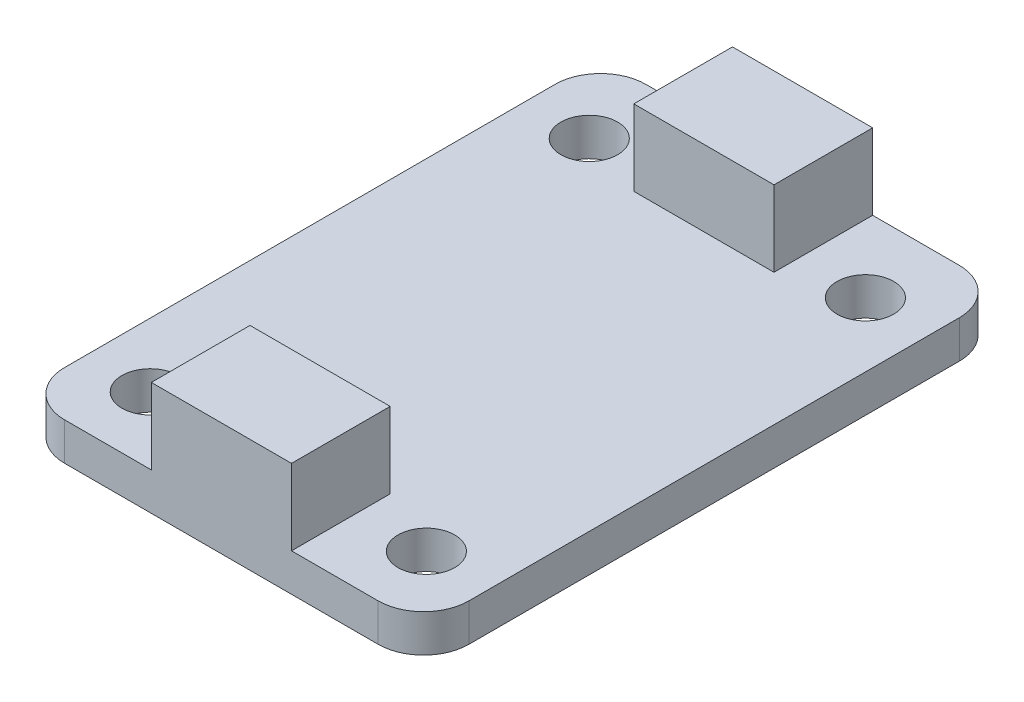
ISO-10303-21;
HEADER;
FILE_DESCRIPTION(('STEP AP214'),'2;1');
FILE_NAME('part.step','',(''),(''),'','','');
FILE_SCHEMA(('AUTOMOTIVE_DESIGN { 1 0 10303 214 1 1 1 1 }'));
ENDSEC;
DATA;
#1=APPLICATION_CONTEXT('core data for automotive mechanical design processes');
#2=APPLICATION_PROTOCOL_DEFINITION('international standard','automotive_design',2000,#1);
#3=PRODUCT_CONTEXT('',#1,'mechanical');
#4=PRODUCT('Part','Part','',(#3));
#5=PRODUCT_RELATED_PRODUCT_CATEGORY('part','',(#4));
#6=PRODUCT_DEFINITION_FORMATION('','',#4);
#7=PRODUCT_DEFINITION_CONTEXT('part definition',#1,'design');
#8=PRODUCT_DEFINITION('design','',#6,#7);
#9=PRODUCT_DEFINITION_SHAPE('','',#8);
#10=(LENGTH_UNIT() NAMED_UNIT(*) SI_UNIT(.MILLI.,.METRE.));
#11=(NAMED_UNIT(*) PLANE_ANGLE_UNIT() SI_UNIT($,.RADIAN.));
#12=(NAMED_UNIT(*) SI_UNIT($,.STERADIAN.) SOLID_ANGLE_UNIT());
#13=UNCERTAINTY_MEASURE_WITH_UNIT(LENGTH_MEASURE(1.E-05),#10,'distance_accuracy_value','');
#14=(GEOMETRIC_REPRESENTATION_CONTEXT(3) GLOBAL_UNCERTAINTY_ASSIGNED_CONTEXT((#13)) GLOBAL_UNIT_ASSIGNED_CONTEXT((#10,
#11,#12)) REPRESENTATION_CONTEXT('',''));
#15=CARTESIAN_POINT('',(0.,0.,0.));
#16=DIRECTION('',(0.,0.,1.));
#17=DIRECTION('',(1.,0.,0.));
#18=AXIS2_PLACEMENT_3D('',#15,#16,#17);
#19=CARTESIAN_POINT('',(-10.397037037037,1.66,-12.2203703703704));
#20=DIRECTION('',(1.,0.,0.));
#21=DIRECTION('',(0.,0.,-1.));
#22=AXIS2_PLACEMENT_3D('',#19,#20,#21);
#23=PLANE('',#22);
#24=DIRECTION('',(0.,0.,1.));
#25=VECTOR('',#24,1.);
#26=CARTESIAN_POINT('',(-10.397037037037,0.,-12.2203703703704));
#27=LINE('',#26,#25);
#28=CARTESIAN_POINT('',(-10.397037037037,0.,-10.2203703703704));
#29=VERTEX_POINT('',#28);
#30=CARTESIAN_POINT('',(-10.397037037037,0.,11.3996296296296));
#31=VERTEX_POINT('',#30);
#32=EDGE_CURVE('E260',#29,#31,#27,.T.);
#33=ORIENTED_EDGE('',*,*,#32,.T.);
#34=DIRECTION('',(0.,-1.,0.));
#35=VECTOR('',#34,1.);
#36=CARTESIAN_POINT('',(-10.397037037037,1.66,11.3996296296296));
#37=LINE('',#36,#35);
#38=CARTESIAN_POINT('',(-10.397037037037,1.66,11.3996296296296));
#39=VERTEX_POINT('',#38);
#40=EDGE_CURVE('E313',#31,#39,#37,.F.);
#41=ORIENTED_EDGE('',*,*,#40,.T.);
#42=DIRECTION('',(0.,0.,1.));
#43=VECTOR('',#42,1.);
#44=CARTESIAN_POINT('',(-10.397037037037,1.66,-12.2203703703704));
#45=LINE('',#44,#43);
#46=CARTESIAN_POINT('',(-10.397037037037,1.66,-10.2203703703704));
#47=VERTEX_POINT('',#46);
#48=EDGE_CURVE('E261',#47,#39,#45,.T.);
#49=ORIENTED_EDGE('',*,*,#48,.F.);
#50=DIRECTION('',(0.,-1.,0.));
#51=VECTOR('',#50,1.);
#52=CARTESIAN_POINT('',(-10.397037037037,1.66,-10.2203703703704));
#53=LINE('',#52,#51);
#54=EDGE_CURVE('E309',#47,#29,#53,.T.);
#55=ORIENTED_EDGE('',*,*,#54,.T.);
#56=EDGE_LOOP('',(#33,#41,#49,#55));
#57=FACE_BOUND('',#56,.T.);
#58=ADVANCED_FACE('F41',(#57),#23,.F.);
#59=CARTESIAN_POINT('',(-10.397037037037,1.66,13.3996296296296));
#60=DIRECTION('',(0.,0.,-1.));
#61=DIRECTION('',(-1.,0.,0.));
#62=AXIS2_PLACEMENT_3D('',#59,#60,#61);
#63=PLANE('',#62);
#64=DIRECTION('',(1.,0.,0.));
#65=VECTOR('',#64,1.);
#66=CARTESIAN_POINT('',(-10.397037037037,1.66,13.3996296296296));
#67=LINE('',#66,#65);
#68=CARTESIAN_POINT('',(-8.39703703703704,1.66,13.3996296296296));
#69=VERTEX_POINT('',#68);
#70=CARTESIAN_POINT('',(-4.57703703703704,1.66,13.3996296296296));
#71=VERTEX_POINT('',#70);
#72=EDGE_CURVE('E267',#69,#71,#67,.T.);
#73=ORIENTED_EDGE('',*,*,#72,.F.);
#74=DIRECTION('',(0.,-1.,0.));
#75=VECTOR('',#74,1.);
#76=CARTESIAN_POINT('',(-8.39703703703704,1.66,13.3996296296296));
#77=LINE('',#76,#75);
#78=CARTESIAN_POINT('',(-8.39703703703704,0.,13.3996296296296));
#79=VERTEX_POINT('',#78);
#80=EDGE_CURVE('E293',#69,#79,#77,.T.);
#81=ORIENTED_EDGE('',*,*,#80,.T.);
#82=DIRECTION('',(1.,0.,0.));
#83=VECTOR('',#82,1.);
#84=CARTESIAN_POINT('',(-10.397037037037,0.,13.3996296296296));
#85=LINE('',#84,#83);
#86=CARTESIAN_POINT('',(5.42296296296296,0.,13.3996296296296));
#87=VERTEX_POINT('',#86);
#88=EDGE_CURVE('E281',#79,#87,#85,.T.);
#89=ORIENTED_EDGE('',*,*,#88,.T.);
#90=DIRECTION('',(0.,-1.,0.));
#91=VECTOR('',#90,1.);
#92=CARTESIAN_POINT('',(5.42296296296296,1.66,13.3996296296296));
#93=LINE('',#92,#91);
#94=CARTESIAN_POINT('',(5.42296296296296,1.66,13.3996296296296));
#95=VERTEX_POINT('',#94);
#96=EDGE_CURVE('E277',#87,#95,#93,.F.);
#97=ORIENTED_EDGE('',*,*,#96,.T.);
#98=CARTESIAN_POINT('',(1.60296296296296,1.66,13.3996296296296));
#99=VERTEX_POINT('',#98);
#100=EDGE_CURVE('E265',#99,#95,#67,.T.);
#101=ORIENTED_EDGE('',*,*,#100,.F.);
#102=DIRECTION('',(0.,-1.,0.));
#103=VECTOR('',#102,1.);
#104=CARTESIAN_POINT('',(1.60296296296296,5.,13.3996296296296));
#105=LINE('',#104,#103);
#106=CARTESIAN_POINT('',(1.60296296296296,5.,13.3996296296296));
#107=VERTEX_POINT('',#106);
#108=EDGE_CURVE('E238',#107,#99,#105,.T.);
#109=ORIENTED_EDGE('',*,*,#108,.F.);
#110=DIRECTION('',(-1.,0.,0.));
#111=VECTOR('',#110,1.);
#112=CARTESIAN_POINT('',(-4.57703703703704,5.,13.3996296296296));
#113=LINE('',#112,#111);
#114=CARTESIAN_POINT('',(-4.57703703703704,5.,13.3996296296296));
#115=VERTEX_POINT('',#114);
#116=EDGE_CURVE('E228',#107,#115,#113,.T.);
#117=ORIENTED_EDGE('',*,*,#116,.T.);
#118=DIRECTION('',(0.,-1.,0.));
#119=VECTOR('',#118,1.);
#120=CARTESIAN_POINT('',(-4.57703703703704,5.,13.3996296296296));
#121=LINE('',#120,#119);
#122=EDGE_CURVE('E233',#115,#71,#121,.T.);
#123=ORIENTED_EDGE('',*,*,#122,.T.);
#124=EDGE_LOOP('',(#73,#81,#89,#97,#101,#109,#117,#123));
#125=FACE_BOUND('',#124,.T.);
#126=ADVANCED_FACE('F354',(#125),#63,.F.);
#127=CARTESIAN_POINT('',(7.42296296296296,1.66,-12.2203703703704));
#128=DIRECTION('',(-1.,0.,0.));
#129=DIRECTION('',(0.,0.,1.));
#130=AXIS2_PLACEMENT_3D('',#127,#128,#129);
#131=PLANE('',#130);
#132=DIRECTION('',(0.,0.,-1.));
#133=VECTOR('',#132,1.);
#134=CARTESIAN_POINT('',(7.42296296296296,1.66,-12.2203703703704));
#135=LINE('',#134,#133);
#136=CARTESIAN_POINT('',(7.42296296296296,1.66,11.3996296296296));
#137=VERTEX_POINT('',#136);
#138=CARTESIAN_POINT('',(7.42296296296296,1.66,-10.2203703703704));
#139=VERTEX_POINT('',#138);
#140=EDGE_CURVE('E270',#137,#139,#135,.T.);
#141=ORIENTED_EDGE('',*,*,#140,.F.);
#142=DIRECTION('',(0.,-1.,0.));
#143=VECTOR('',#142,1.);
#144=CARTESIAN_POINT('',(7.42296296296296,1.66,11.3996296296296));
#145=LINE('',#144,#143);
#146=CARTESIAN_POINT('',(7.42296296296296,0.,11.3996296296296));
#147=VERTEX_POINT('',#146);
#148=EDGE_CURVE('E329',#137,#147,#145,.T.);
#149=ORIENTED_EDGE('',*,*,#148,.T.);
#150=DIRECTION('',(0.,0.,-1.));
#151=VECTOR('',#150,1.);
#152=CARTESIAN_POINT('',(7.42296296296296,0.,-12.2203703703704));
#153=LINE('',#152,#151);
#154=CARTESIAN_POINT('',(7.42296296296296,0.,-10.2203703703704));
#155=VERTEX_POINT('',#154);
#156=EDGE_CURVE('E285',#147,#155,#153,.T.);
#157=ORIENTED_EDGE('',*,*,#156,.T.);
#158=DIRECTION('',(0.,-1.,0.));
#159=VECTOR('',#158,1.);
#160=CARTESIAN_POINT('',(7.42296296296296,1.66,-10.2203703703704));
#161=LINE('',#160,#159);
#162=EDGE_CURVE('E65',#155,#139,#161,.F.);
#163=ORIENTED_EDGE('',*,*,#162,.T.);
#164=EDGE_LOOP('',(#141,#149,#157,#163));
#165=FACE_BOUND('',#164,.T.);
#166=ADVANCED_FACE('F375',(#165),#131,.F.);
#167=CARTESIAN_POINT('',(-10.397037037037,1.66,-12.2203703703704));
#168=DIRECTION('',(0.,0.,1.));
#169=DIRECTION('',(1.,0.,0.));
#170=AXIS2_PLACEMENT_3D('',#167,#168,#169);
#171=PLANE('',#170);
#172=DIRECTION('',(-1.,0.,0.));
#173=VECTOR('',#172,1.);
#174=CARTESIAN_POINT('',(-10.397037037037,1.66,-12.2203703703704));
#175=LINE('',#174,#173);
#176=CARTESIAN_POINT('',(5.42296296296295,1.66,-12.2203703703704));
#177=VERTEX_POINT('',#176);
#178=CARTESIAN_POINT('',(1.60296296296296,1.66,-12.2203703703704));
#179=VERTEX_POINT('',#178);
#180=EDGE_CURVE('E274',#177,#179,#175,.T.);
#181=ORIENTED_EDGE('',*,*,#180,.F.);
#182=DIRECTION('',(0.,-1.,0.));
#183=VECTOR('',#182,1.);
#184=CARTESIAN_POINT('',(5.42296296296295,1.66,-12.2203703703704));
#185=LINE('',#184,#183);
#186=CARTESIAN_POINT('',(5.42296296296295,0.,-12.2203703703704));
#187=VERTEX_POINT('',#186);
#188=EDGE_CURVE('E11',#177,#187,#185,.T.);
#189=ORIENTED_EDGE('',*,*,#188,.T.);
#190=DIRECTION('',(-1.,0.,0.));
#191=VECTOR('',#190,1.);
#192=CARTESIAN_POINT('',(-10.397037037037,0.,-12.2203703703704));
#193=LINE('',#192,#191);
#194=CARTESIAN_POINT('',(-8.39703703703704,0.,-12.2203703703704));
#195=VERTEX_POINT('',#194);
#196=EDGE_CURVE('E266',#187,#195,#193,.T.);
#197=ORIENTED_EDGE('',*,*,#196,.T.);
#198=DIRECTION('',(0.,-1.,0.));
#199=VECTOR('',#198,1.);
#200=CARTESIAN_POINT('',(-8.39703703703704,1.66,-12.2203703703704));
#201=LINE('',#200,#199);
#202=CARTESIAN_POINT('',(-8.39703703703704,1.66,-12.2203703703704));
#203=VERTEX_POINT('',#202);
#204=EDGE_CURVE('E50',#195,#203,#201,.F.);
#205=ORIENTED_EDGE('',*,*,#204,.T.);
#206=CARTESIAN_POINT('',(-4.57703703703703,1.66,-12.2203703703704));
#207=VERTEX_POINT('',#206);
#208=EDGE_CURVE('E273',#207,#203,#175,.T.);
#209=ORIENTED_EDGE('',*,*,#208,.F.);
#210=DIRECTION('',(0.,-1.,0.));
#211=VECTOR('',#210,1.);
#212=CARTESIAN_POINT('',(-4.57703703703703,5.,-12.2203703703704));
#213=LINE('',#212,#211);
#214=CARTESIAN_POINT('',(-4.57703703703703,5.,-12.2203703703704));
#215=VERTEX_POINT('',#214);
#216=EDGE_CURVE('E184',#215,#207,#213,.T.);
#217=ORIENTED_EDGE('',*,*,#216,.F.);
#218=DIRECTION('',(1.,0.,0.));
#219=VECTOR('',#218,1.);
#220=CARTESIAN_POINT('',(-4.57703703703703,5.,-12.2203703703704));
#221=LINE('',#220,#219);
#222=CARTESIAN_POINT('',(1.60296296296296,5.,-12.2203703703704));
#223=VERTEX_POINT('',#222);
#224=EDGE_CURVE('E175',#215,#223,#221,.T.);
#225=ORIENTED_EDGE('',*,*,#224,.T.);
#226=DIRECTION('',(0.,-1.,0.));
#227=VECTOR('',#226,1.);
#228=CARTESIAN_POINT('',(1.60296296296296,5.,-12.2203703703704));
#229=LINE('',#228,#227);
#230=EDGE_CURVE('E158',#223,#179,#229,.T.);
#231=ORIENTED_EDGE('',*,*,#230,.T.);
#232=EDGE_LOOP('',(#181,#189,#197,#205,#209,#217,#225,#231));
#233=FACE_BOUND('',#232,.T.);
#234=ADVANCED_FACE('F181',(#233),#171,.F.);
#235=CARTESIAN_POINT('',(0.,1.66,0.));
#236=DIRECTION('',(0.,1.,0.));
#237=DIRECTION('',(0.,0.,1.));
#238=AXIS2_PLACEMENT_3D('',#235,#236,#237);
#239=PLANE('',#238);
#240=CARTESIAN_POINT('',(4.59172783828321,1.66,10.4435621899189));
#241=DIRECTION('',(0.,1.,0.));
#242=DIRECTION('',(0.,0.,1.));
#243=AXIS2_PLACEMENT_3D('',#240,#241,#242);
#244=CIRCLE('',#243,1.25000000000001);
#245=CARTESIAN_POINT('',(4.59172783828321,1.66,11.6935621899189));
#246=VERTEX_POINT('',#245);
#247=EDGE_CURVE('E580',#246,#246,#244,.T.);
#248=ORIENTED_EDGE('',*,*,#247,.F.);
#249=EDGE_LOOP('',(#248));
#250=FACE_BOUND('',#249,.T.);
#251=CARTESIAN_POINT('',(-7.58002426523841,1.66,10.4435621899189));
#252=DIRECTION('',(0.,1.,0.));
#253=DIRECTION('',(0.,0.,1.));
#254=AXIS2_PLACEMENT_3D('',#251,#252,#253);
#255=CIRCLE('',#254,1.25000000000001);
#256=CARTESIAN_POINT('',(-7.58002426523841,1.66,11.6935621899189));
#257=VERTEX_POINT('',#256);
#258=EDGE_CURVE('E584',#257,#257,#255,.T.);
#259=ORIENTED_EDGE('',*,*,#258,.F.);
#260=EDGE_LOOP('',(#259));
#261=FACE_BOUND('',#260,.T.);
#262=CARTESIAN_POINT('',(-7.58002426523841,1.66,-8.90960334853673));
#263=DIRECTION('',(0.,1.,0.));
#264=DIRECTION('',(0.,0.,1.));
#265=AXIS2_PLACEMENT_3D('',#262,#263,#264);
#266=CIRCLE('',#265,1.25000000000001);
#267=CARTESIAN_POINT('',(-7.58002426523841,1.66,-7.65960334853671));
#268=VERTEX_POINT('',#267);
#269=EDGE_CURVE('E594',#268,#268,#266,.T.);
#270=ORIENTED_EDGE('',*,*,#269,.F.);
#271=EDGE_LOOP('',(#270));
#272=FACE_BOUND('',#271,.T.);
#273=CARTESIAN_POINT('',(4.59172783828321,1.66,-8.90960334853673));
#274=DIRECTION('',(0.,1.,0.));
#275=DIRECTION('',(0.,0.,1.));
#276=AXIS2_PLACEMENT_3D('',#273,#274,#275);
#277=CIRCLE('',#276,1.25000000000001);
#278=CARTESIAN_POINT('',(4.59172783828321,1.66,-7.65960334853671));
#279=VERTEX_POINT('',#278);
#280=EDGE_CURVE('E190',#279,#279,#277,.T.);
#281=ORIENTED_EDGE('',*,*,#280,.F.);
#282=EDGE_LOOP('',(#281));
#283=FACE_BOUND('',#282,.T.);
#284=ORIENTED_EDGE('',*,*,#48,.T.);
#285=CARTESIAN_POINT('',(-8.39703703703704,1.66,11.3996296296296));
#286=DIRECTION('',(0.,1.,0.));
#287=DIRECTION('',(0.,0.,1.));
#288=AXIS2_PLACEMENT_3D('',#285,#286,#287);
#289=CIRCLE('',#288,2.);
#290=EDGE_CURVE('E324',#39,#69,#289,.T.);
#291=ORIENTED_EDGE('',*,*,#290,.T.);
#292=ORIENTED_EDGE('',*,*,#72,.T.);
#293=DIRECTION('',(0.,0.,1.));
#294=VECTOR('',#293,1.);
#295=CARTESIAN_POINT('',(-4.57703703703704,1.66,0.));
#296=LINE('',#295,#294);
#297=CARTESIAN_POINT('',(-4.57703703703704,1.66,9.04962962962964));
#298=VERTEX_POINT('',#297);
#299=EDGE_CURVE('E256',#298,#71,#296,.T.);
#300=ORIENTED_EDGE('',*,*,#299,.F.);
#301=DIRECTION('',(-1.,0.,0.));
#302=VECTOR('',#301,1.);
#303=CARTESIAN_POINT('',(0.,1.66,9.04962962962964));
#304=LINE('',#303,#302);
#305=CARTESIAN_POINT('',(1.60296296296296,1.66,9.04962962962964));
#306=VERTEX_POINT('',#305);
#307=EDGE_CURVE('E237',#306,#298,#304,.T.);
#308=ORIENTED_EDGE('',*,*,#307,.F.);
#309=DIRECTION('',(0.,0.,-1.));
#310=VECTOR('',#309,1.);
#311=CARTESIAN_POINT('',(1.60296296296297,1.66,0.));
#312=LINE('',#311,#310);
#313=EDGE_CURVE('E252',#99,#306,#312,.T.);
#314=ORIENTED_EDGE('',*,*,#313,.F.);
#315=ORIENTED_EDGE('',*,*,#100,.T.);
#316=CARTESIAN_POINT('',(5.42296296296296,1.66,11.3996296296296));
#317=DIRECTION('',(0.,1.,0.));
#318=DIRECTION('',(0.,0.,1.));
#319=AXIS2_PLACEMENT_3D('',#316,#317,#318);
#320=CIRCLE('',#319,2.);
#321=EDGE_CURVE('E321',#95,#137,#320,.T.);
#322=ORIENTED_EDGE('',*,*,#321,.T.);
#323=ORIENTED_EDGE('',*,*,#140,.T.);
#324=CARTESIAN_POINT('',(5.42296296296295,1.66,-10.2203703703704));
#325=DIRECTION('',(0.,1.,0.));
#326=DIRECTION('',(0.,0.,1.));
#327=AXIS2_PLACEMENT_3D('',#324,#325,#326);
#328=CIRCLE('',#327,2.);
#329=EDGE_CURVE('E57',#139,#177,#328,.T.);
#330=ORIENTED_EDGE('',*,*,#329,.T.);
#331=ORIENTED_EDGE('',*,*,#180,.T.);
#332=DIRECTION('',(0.,0.,-1.));
#333=VECTOR('',#332,1.);
#334=CARTESIAN_POINT('',(1.60296296296297,1.66,0.));
#335=LINE('',#334,#333);
#336=CARTESIAN_POINT('',(1.60296296296296,1.66,-7.87037037037037));
#337=VERTEX_POINT('',#336);
#338=EDGE_CURVE('E163',#337,#179,#335,.T.);
#339=ORIENTED_EDGE('',*,*,#338,.F.);
#340=DIRECTION('',(1.,0.,0.));
#341=VECTOR('',#340,1.);
#342=CARTESIAN_POINT('',(0.,1.66,-7.87037037037037));
#343=LINE('',#342,#341);
#344=CARTESIAN_POINT('',(-4.57703703703704,1.66,-7.87037037037037));
#345=VERTEX_POINT('',#344);
#346=EDGE_CURVE('E208',#345,#337,#343,.T.);
#347=ORIENTED_EDGE('',*,*,#346,.F.);
#348=DIRECTION('',(0.,0.,1.));
#349=VECTOR('',#348,1.);
#350=CARTESIAN_POINT('',(-4.57703703703704,1.66,0.));
#351=LINE('',#350,#349);
#352=EDGE_CURVE('E212',#207,#345,#351,.T.);
#353=ORIENTED_EDGE('',*,*,#352,.F.);
#354=ORIENTED_EDGE('',*,*,#208,.T.);
#355=CARTESIAN_POINT('',(-8.39703703703704,1.66,-10.2203703703704));
#356=DIRECTION('',(0.,1.,0.));
#357=DIRECTION('',(0.,0.,1.));
#358=AXIS2_PLACEMENT_3D('',#355,#356,#357);
#359=CIRCLE('',#358,2.);
#360=EDGE_CURVE('E316',#203,#47,#359,.T.);
#361=ORIENTED_EDGE('',*,*,#360,.T.);
#362=EDGE_LOOP('',(#284,#291,#292,#300,#308,#314,#315,#322,#323,#330,#331,#339,#347,#353,#354,#361));
#363=FACE_BOUND('',#362,.T.);
#364=ADVANCED_FACE('F338',(#250,#261,#272,#283,#363),#239,.T.);
#365=CARTESIAN_POINT('',(0.,0.,0.));
#366=DIRECTION('',(0.,1.,0.));
#367=DIRECTION('',(0.,0.,1.));
#368=AXIS2_PLACEMENT_3D('',#365,#366,#367);
#369=PLANE('',#368);
#370=CARTESIAN_POINT('',(4.59172783828321,0.,10.4435621899189));
#371=DIRECTION('',(0.,1.,0.));
#372=DIRECTION('',(0.,0.,1.));
#373=AXIS2_PLACEMENT_3D('',#370,#371,#372);
#374=CIRCLE('',#373,1.25000000000001);
#375=CARTESIAN_POINT('',(4.59172783828321,0.,11.6935621899189));
#376=VERTEX_POINT('',#375);
#377=EDGE_CURVE('E577',#376,#376,#374,.T.);
#378=ORIENTED_EDGE('',*,*,#377,.T.);
#379=EDGE_LOOP('',(#378));
#380=FACE_BOUND('',#379,.T.);
#381=CARTESIAN_POINT('',(-7.58002426523841,0.,10.4435621899189));
#382=DIRECTION('',(0.,1.,0.));
#383=DIRECTION('',(0.,0.,1.));
#384=AXIS2_PLACEMENT_3D('',#381,#382,#383);
#385=CIRCLE('',#384,1.25000000000001);
#386=CARTESIAN_POINT('',(-7.58002426523841,0.,11.6935621899189));
#387=VERTEX_POINT('',#386);
#388=EDGE_CURVE('E590',#387,#387,#385,.T.);
#389=ORIENTED_EDGE('',*,*,#388,.T.);
#390=EDGE_LOOP('',(#389));
#391=FACE_BOUND('',#390,.T.);
#392=CARTESIAN_POINT('',(-7.58002426523841,0.,-8.90960334853673));
#393=DIRECTION('',(0.,1.,0.));
#394=DIRECTION('',(0.,0.,1.));
#395=AXIS2_PLACEMENT_3D('',#392,#393,#394);
#396=CIRCLE('',#395,1.25000000000001);
#397=CARTESIAN_POINT('',(-7.58002426523841,0.,-7.65960334853671));
#398=VERTEX_POINT('',#397);
#399=EDGE_CURVE('E598',#398,#398,#396,.T.);
#400=ORIENTED_EDGE('',*,*,#399,.T.);
#401=EDGE_LOOP('',(#400));
#402=FACE_BOUND('',#401,.T.);
#403=CARTESIAN_POINT('',(4.59172783828321,0.,-8.90960334853673));
#404=DIRECTION('',(0.,1.,0.));
#405=DIRECTION('',(0.,0.,1.));
#406=AXIS2_PLACEMENT_3D('',#403,#404,#405);
#407=CIRCLE('',#406,1.25000000000001);
#408=CARTESIAN_POINT('',(4.59172783828321,0.,-7.65960334853671));
#409=VERTEX_POINT('',#408);
#410=EDGE_CURVE('E186',#409,#409,#407,.T.);
#411=ORIENTED_EDGE('',*,*,#410,.T.);
#412=EDGE_LOOP('',(#411));
#413=FACE_BOUND('',#412,.T.);
#414=ORIENTED_EDGE('',*,*,#88,.F.);
#415=CARTESIAN_POINT('',(-8.39703703703704,0.,11.3996296296296));
#416=DIRECTION('',(0.,1.,0.));
#417=DIRECTION('',(0.,0.,1.));
#418=AXIS2_PLACEMENT_3D('',#415,#416,#417);
#419=CIRCLE('',#418,2.);
#420=EDGE_CURVE('E306',#79,#31,#419,.F.);
#421=ORIENTED_EDGE('',*,*,#420,.T.);
#422=ORIENTED_EDGE('',*,*,#32,.F.);
#423=CARTESIAN_POINT('',(-8.39703703703704,0.,-10.2203703703704));
#424=DIRECTION('',(0.,1.,0.));
#425=DIRECTION('',(0.,0.,1.));
#426=AXIS2_PLACEMENT_3D('',#423,#424,#425);
#427=CIRCLE('',#426,2.);
#428=EDGE_CURVE('E297',#29,#195,#427,.F.);
#429=ORIENTED_EDGE('',*,*,#428,.T.);
#430=ORIENTED_EDGE('',*,*,#196,.F.);
#431=CARTESIAN_POINT('',(5.42296296296295,0.,-10.2203703703704));
#432=DIRECTION('',(0.,1.,0.));
#433=DIRECTION('',(0.,0.,1.));
#434=AXIS2_PLACEMENT_3D('',#431,#432,#433);
#435=CIRCLE('',#434,2.);
#436=EDGE_CURVE('E300',#187,#155,#435,.F.);
#437=ORIENTED_EDGE('',*,*,#436,.T.);
#438=ORIENTED_EDGE('',*,*,#156,.F.);
#439=CARTESIAN_POINT('',(5.42296296296296,0.,11.3996296296296));
#440=DIRECTION('',(0.,1.,0.));
#441=DIRECTION('',(0.,0.,1.));
#442=AXIS2_PLACEMENT_3D('',#439,#440,#441);
#443=CIRCLE('',#442,2.);
#444=EDGE_CURVE('E303',#147,#87,#443,.F.);
#445=ORIENTED_EDGE('',*,*,#444,.T.);
#446=EDGE_LOOP('',(#414,#421,#422,#429,#430,#437,#438,#445));
#447=FACE_BOUND('',#446,.T.);
#448=ADVANCED_FACE('F347',(#380,#391,#402,#413,#447),#369,.F.);
#449=CARTESIAN_POINT('',(-4.57703703703704,5.,13.3996296296296));
#450=DIRECTION('',(-1.,0.,0.));
#451=DIRECTION('',(0.,0.,1.));
#452=AXIS2_PLACEMENT_3D('',#449,#450,#451);
#453=PLANE('',#452);
#454=DIRECTION('',(0.,-1.,0.));
#455=VECTOR('',#454,1.);
#456=CARTESIAN_POINT('',(-4.57703703703704,5.,9.04962962962964));
#457=LINE('',#456,#455);
#458=CARTESIAN_POINT('',(-4.57703703703704,5.,9.04962962962964));
#459=VERTEX_POINT('',#458);
#460=EDGE_CURVE('E232',#459,#298,#457,.T.);
#461=ORIENTED_EDGE('',*,*,#460,.T.);
#462=ORIENTED_EDGE('',*,*,#299,.T.);
#463=ORIENTED_EDGE('',*,*,#122,.F.);
#464=DIRECTION('',(0.,0.,-1.));
#465=VECTOR('',#464,1.);
#466=CARTESIAN_POINT('',(-4.57703703703704,5.,13.3996296296296));
#467=LINE('',#466,#465);
#468=EDGE_CURVE('E216',#115,#459,#467,.T.);
#469=ORIENTED_EDGE('',*,*,#468,.T.);
#470=EDGE_LOOP('',(#461,#462,#463,#469));
#471=FACE_BOUND('',#470,.T.);
#472=ADVANCED_FACE('F357',(#471),#453,.T.);
#473=CARTESIAN_POINT('',(1.60296296296296,5.,13.3996296296296));
#474=DIRECTION('',(1.,0.,0.));
#475=DIRECTION('',(0.,0.,-1.));
#476=AXIS2_PLACEMENT_3D('',#473,#474,#475);
#477=PLANE('',#476);
#478=ORIENTED_EDGE('',*,*,#108,.T.);
#479=ORIENTED_EDGE('',*,*,#313,.T.);
#480=DIRECTION('',(0.,-1.,0.));
#481=VECTOR('',#480,1.);
#482=CARTESIAN_POINT('',(1.60296296296296,5.,9.04962962962964));
#483=LINE('',#482,#481);
#484=CARTESIAN_POINT('',(1.60296296296296,5.,9.04962962962964));
#485=VERTEX_POINT('',#484);
#486=EDGE_CURVE('E242',#485,#306,#483,.T.);
#487=ORIENTED_EDGE('',*,*,#486,.F.);
#488=DIRECTION('',(0.,0.,1.));
#489=VECTOR('',#488,1.);
#490=CARTESIAN_POINT('',(1.60296296296296,5.,13.3996296296296));
#491=LINE('',#490,#489);
#492=EDGE_CURVE('E224',#485,#107,#491,.T.);
#493=ORIENTED_EDGE('',*,*,#492,.T.);
#494=EDGE_LOOP('',(#478,#479,#487,#493));
#495=FACE_BOUND('',#494,.T.);
#496=ADVANCED_FACE('F367',(#495),#477,.T.);
#497=CARTESIAN_POINT('',(-4.57703703703704,5.,9.04962962962964));
#498=DIRECTION('',(0.,0.,-1.));
#499=DIRECTION('',(-1.,0.,0.));
#500=AXIS2_PLACEMENT_3D('',#497,#498,#499);
#501=PLANE('',#500);
#502=ORIENTED_EDGE('',*,*,#486,.T.);
#503=ORIENTED_EDGE('',*,*,#307,.T.);
#504=ORIENTED_EDGE('',*,*,#460,.F.);
#505=DIRECTION('',(1.,0.,0.));
#506=VECTOR('',#505,1.);
#507=CARTESIAN_POINT('',(-4.57703703703704,5.,9.04962962962964));
#508=LINE('',#507,#506);
#509=EDGE_CURVE('E220',#459,#485,#508,.T.);
#510=ORIENTED_EDGE('',*,*,#509,.T.);
#511=EDGE_LOOP('',(#502,#503,#504,#510));
#512=FACE_BOUND('',#511,.T.);
#513=ADVANCED_FACE('F361',(#512),#501,.T.);
#514=CARTESIAN_POINT('',(0.,5.,0.));
#515=DIRECTION('',(0.,-1.,0.));
#516=DIRECTION('',(0.,0.,-1.));
#517=AXIS2_PLACEMENT_3D('',#514,#515,#516);
#518=PLANE('',#517);
#519=ORIENTED_EDGE('',*,*,#468,.F.);
#520=ORIENTED_EDGE('',*,*,#116,.F.);
#521=ORIENTED_EDGE('',*,*,#492,.F.);
#522=ORIENTED_EDGE('',*,*,#509,.F.);
#523=EDGE_LOOP('',(#519,#520,#521,#522));
#524=FACE_BOUND('',#523,.T.);
#525=ADVANCED_FACE('F364',(#524),#518,.F.);
#526=CARTESIAN_POINT('',(-4.57703703703703,5.,-12.2203703703704));
#527=DIRECTION('',(-1.,0.,0.));
#528=DIRECTION('',(0.,0.,1.));
#529=AXIS2_PLACEMENT_3D('',#526,#527,#528);
#530=PLANE('',#529);
#531=ORIENTED_EDGE('',*,*,#216,.T.);
#532=ORIENTED_EDGE('',*,*,#352,.T.);
#533=DIRECTION('',(0.,-1.,0.));
#534=VECTOR('',#533,1.);
#535=CARTESIAN_POINT('',(-4.57703703703704,5.,-7.87037037037037));
#536=LINE('',#535,#534);
#537=CARTESIAN_POINT('',(-4.57703703703704,5.,-7.87037037037037));
#538=VERTEX_POINT('',#537);
#539=EDGE_CURVE('E200',#538,#345,#536,.T.);
#540=ORIENTED_EDGE('',*,*,#539,.F.);
#541=DIRECTION('',(0.,0.,-1.));
#542=VECTOR('',#541,1.);
#543=CARTESIAN_POINT('',(-4.57703703703703,5.,-12.2203703703704));
#544=LINE('',#543,#542);
#545=EDGE_CURVE('E168',#538,#215,#544,.T.);
#546=ORIENTED_EDGE('',*,*,#545,.T.);
#547=EDGE_LOOP('',(#531,#532,#540,#546));
#548=FACE_BOUND('',#547,.T.);
#549=ADVANCED_FACE('F383',(#548),#530,.T.);
#550=CARTESIAN_POINT('',(-4.57703703703704,5.,-7.87037037037037));
#551=DIRECTION('',(0.,0.,1.));
#552=DIRECTION('',(1.,0.,0.));
#553=AXIS2_PLACEMENT_3D('',#550,#551,#552);
#554=PLANE('',#553);
#555=ORIENTED_EDGE('',*,*,#539,.T.);
#556=ORIENTED_EDGE('',*,*,#346,.T.);
#557=DIRECTION('',(0.,-1.,0.));
#558=VECTOR('',#557,1.);
#559=CARTESIAN_POINT('',(1.60296296296296,5.,-7.87037037037037));
#560=LINE('',#559,#558);
#561=CARTESIAN_POINT('',(1.60296296296296,5.,-7.87037037037037));
#562=VERTEX_POINT('',#561);
#563=EDGE_CURVE('E167',#562,#337,#560,.T.);
#564=ORIENTED_EDGE('',*,*,#563,.F.);
#565=DIRECTION('',(-1.,0.,0.));
#566=VECTOR('',#565,1.);
#567=CARTESIAN_POINT('',(-4.57703703703704,5.,-7.87037037037037));
#568=LINE('',#567,#566);
#569=EDGE_CURVE('E178',#562,#538,#568,.T.);
#570=ORIENTED_EDGE('',*,*,#569,.T.);
#571=EDGE_LOOP('',(#555,#556,#564,#570));
#572=FACE_BOUND('',#571,.T.);
#573=ADVANCED_FACE('F381',(#572),#554,.T.);
#574=CARTESIAN_POINT('',(1.60296296296296,5.,-12.2203703703704));
#575=DIRECTION('',(1.,0.,0.));
#576=DIRECTION('',(0.,0.,-1.));
#577=AXIS2_PLACEMENT_3D('',#574,#575,#576);
#578=PLANE('',#577);
#579=ORIENTED_EDGE('',*,*,#563,.T.);
#580=ORIENTED_EDGE('',*,*,#338,.T.);
#581=ORIENTED_EDGE('',*,*,#230,.F.);
#582=DIRECTION('',(0.,0.,1.));
#583=VECTOR('',#582,1.);
#584=CARTESIAN_POINT('',(1.60296296296296,5.,-12.2203703703704));
#585=LINE('',#584,#583);
#586=EDGE_CURVE('E162',#223,#562,#585,.T.);
#587=ORIENTED_EDGE('',*,*,#586,.T.);
#588=EDGE_LOOP('',(#579,#580,#581,#587));
#589=FACE_BOUND('',#588,.T.);
#590=ADVANCED_FACE('F161',(#589),#578,.T.);
#591=CARTESIAN_POINT('',(0.,5.,0.));
#592=DIRECTION('',(0.,-1.,0.));
#593=DIRECTION('',(0.,0.,-1.));
#594=AXIS2_PLACEMENT_3D('',#591,#592,#593);
#595=PLANE('',#594);
#596=ORIENTED_EDGE('',*,*,#224,.F.);
#597=ORIENTED_EDGE('',*,*,#545,.F.);
#598=ORIENTED_EDGE('',*,*,#569,.F.);
#599=ORIENTED_EDGE('',*,*,#586,.F.);
#600=EDGE_LOOP('',(#596,#597,#598,#599));
#601=FACE_BOUND('',#600,.T.);
#602=ADVANCED_FACE('F173',(#601),#595,.F.);
#603=CARTESIAN_POINT('',(-8.39703703703704,1.66,11.3996296296296));
#604=DIRECTION('',(0.,-1.,0.));
#605=DIRECTION('',(0.,0.,-1.));
#606=AXIS2_PLACEMENT_3D('',#603,#604,#605);
#607=CYLINDRICAL_SURFACE('',#606,2.);
#608=ORIENTED_EDGE('',*,*,#290,.F.);
#609=ORIENTED_EDGE('',*,*,#40,.F.);
#610=ORIENTED_EDGE('',*,*,#420,.F.);
#611=ORIENTED_EDGE('',*,*,#80,.F.);
#612=EDGE_LOOP('',(#608,#609,#610,#611));
#613=FACE_BOUND('',#612,.T.);
#614=ADVANCED_FACE('F351',(#613),#607,.T.);
#615=CARTESIAN_POINT('',(5.42296296296296,1.66,11.3996296296296));
#616=DIRECTION('',(0.,-1.,0.));
#617=DIRECTION('',(0.,0.,-1.));
#618=AXIS2_PLACEMENT_3D('',#615,#616,#617);
#619=CYLINDRICAL_SURFACE('',#618,2.);
#620=ORIENTED_EDGE('',*,*,#321,.F.);
#621=ORIENTED_EDGE('',*,*,#96,.F.);
#622=ORIENTED_EDGE('',*,*,#444,.F.);
#623=ORIENTED_EDGE('',*,*,#148,.F.);
#624=EDGE_LOOP('',(#620,#621,#622,#623));
#625=FACE_BOUND('',#624,.T.);
#626=ADVANCED_FACE('F373',(#625),#619,.T.);
#627=CARTESIAN_POINT('',(5.42296296296295,1.66,-10.2203703703704));
#628=DIRECTION('',(0.,-1.,0.));
#629=DIRECTION('',(0.,0.,-1.));
#630=AXIS2_PLACEMENT_3D('',#627,#628,#629);
#631=CYLINDRICAL_SURFACE('',#630,2.);
#632=ORIENTED_EDGE('',*,*,#329,.F.);
#633=ORIENTED_EDGE('',*,*,#162,.F.);
#634=ORIENTED_EDGE('',*,*,#436,.F.);
#635=ORIENTED_EDGE('',*,*,#188,.F.);
#636=EDGE_LOOP('',(#632,#633,#634,#635));
#637=FACE_BOUND('',#636,.T.);
#638=ADVANCED_FACE('F379',(#637),#631,.T.);
#639=CARTESIAN_POINT('',(-8.39703703703704,1.66,-10.2203703703704));
#640=DIRECTION('',(0.,-1.,0.));
#641=DIRECTION('',(0.,0.,-1.));
#642=AXIS2_PLACEMENT_3D('',#639,#640,#641);
#643=CYLINDRICAL_SURFACE('',#642,2.);
#644=ORIENTED_EDGE('',*,*,#360,.F.);
#645=ORIENTED_EDGE('',*,*,#204,.F.);
#646=ORIENTED_EDGE('',*,*,#428,.F.);
#647=ORIENTED_EDGE('',*,*,#54,.F.);
#648=EDGE_LOOP('',(#644,#645,#646,#647));
#649=FACE_BOUND('',#648,.T.);
#650=ADVANCED_FACE('F43',(#649),#643,.T.);
#651=CARTESIAN_POINT('',(4.59172783828321,1.66,-8.90960334853673));
#652=DIRECTION('',(0.,1.,0.));
#653=DIRECTION('',(0.,0.,1.));
#654=AXIS2_PLACEMENT_3D('',#651,#652,#653);
#655=CYLINDRICAL_SURFACE('',#654,1.25000000000001);
#656=ORIENTED_EDGE('',*,*,#410,.F.);
#657=EDGE_LOOP('',(#656));
#658=FACE_BOUND('',#657,.T.);
#659=ORIENTED_EDGE('',*,*,#280,.T.);
#660=EDGE_LOOP('',(#659));
#661=FACE_BOUND('',#660,.T.);
#662=ADVANCED_FACE('F408',(#658,#661),#655,.F.);
#663=CARTESIAN_POINT('',(-7.58002426523841,1.66,-8.90960334853673));
#664=DIRECTION('',(0.,1.,0.));
#665=DIRECTION('',(0.,0.,1.));
#666=AXIS2_PLACEMENT_3D('',#663,#664,#665);
#667=CYLINDRICAL_SURFACE('',#666,1.25000000000001);
#668=ORIENTED_EDGE('',*,*,#399,.F.);
#669=EDGE_LOOP('',(#668));
#670=FACE_BOUND('',#669,.T.);
#671=ORIENTED_EDGE('',*,*,#269,.T.);
#672=EDGE_LOOP('',(#671));
#673=FACE_BOUND('',#672,.T.);
#674=ADVANCED_FACE('F412',(#670,#673),#667,.F.);
#675=CARTESIAN_POINT('',(-7.58002426523841,1.66,10.4435621899189));
#676=DIRECTION('',(0.,1.,0.));
#677=DIRECTION('',(0.,0.,1.));
#678=AXIS2_PLACEMENT_3D('',#675,#676,#677);
#679=CYLINDRICAL_SURFACE('',#678,1.25000000000001);
#680=ORIENTED_EDGE('',*,*,#388,.F.);
#681=EDGE_LOOP('',(#680));
#682=FACE_BOUND('',#681,.T.);
#683=ORIENTED_EDGE('',*,*,#258,.T.);
#684=EDGE_LOOP('',(#683));
#685=FACE_BOUND('',#684,.T.);
#686=ADVANCED_FACE('F418',(#682,#685),#679,.F.);
#687=CARTESIAN_POINT('',(4.59172783828321,1.66,10.4435621899189));
#688=DIRECTION('',(0.,1.,0.));
#689=DIRECTION('',(0.,0.,1.));
#690=AXIS2_PLACEMENT_3D('',#687,#688,#689);
#691=CYLINDRICAL_SURFACE('',#690,1.25000000000001);
#692=ORIENTED_EDGE('',*,*,#377,.F.);
#693=EDGE_LOOP('',(#692));
#694=FACE_BOUND('',#693,.T.);
#695=ORIENTED_EDGE('',*,*,#247,.T.);
#696=EDGE_LOOP('',(#695));
#697=FACE_BOUND('',#696,.T.);
#698=ADVANCED_FACE('F561',(#694,#697),#691,.F.);
#699=CLOSED_SHELL('',(#58,#126,#166,#234,#364,#448,#472,#496,#513,#525,#549,#573,#590,#602,#614,
#626,#638,#650,#662,#674,#686,#698));
#700=MANIFOLD_SOLID_BREP('B2',#699);
#701=ADVANCED_BREP_SHAPE_REPRESENTATION('',(#18,#700),#14);
#702=SHAPE_DEFINITION_REPRESENTATION(#9,#701);
ENDSEC;
END-ISO-10303-21;
